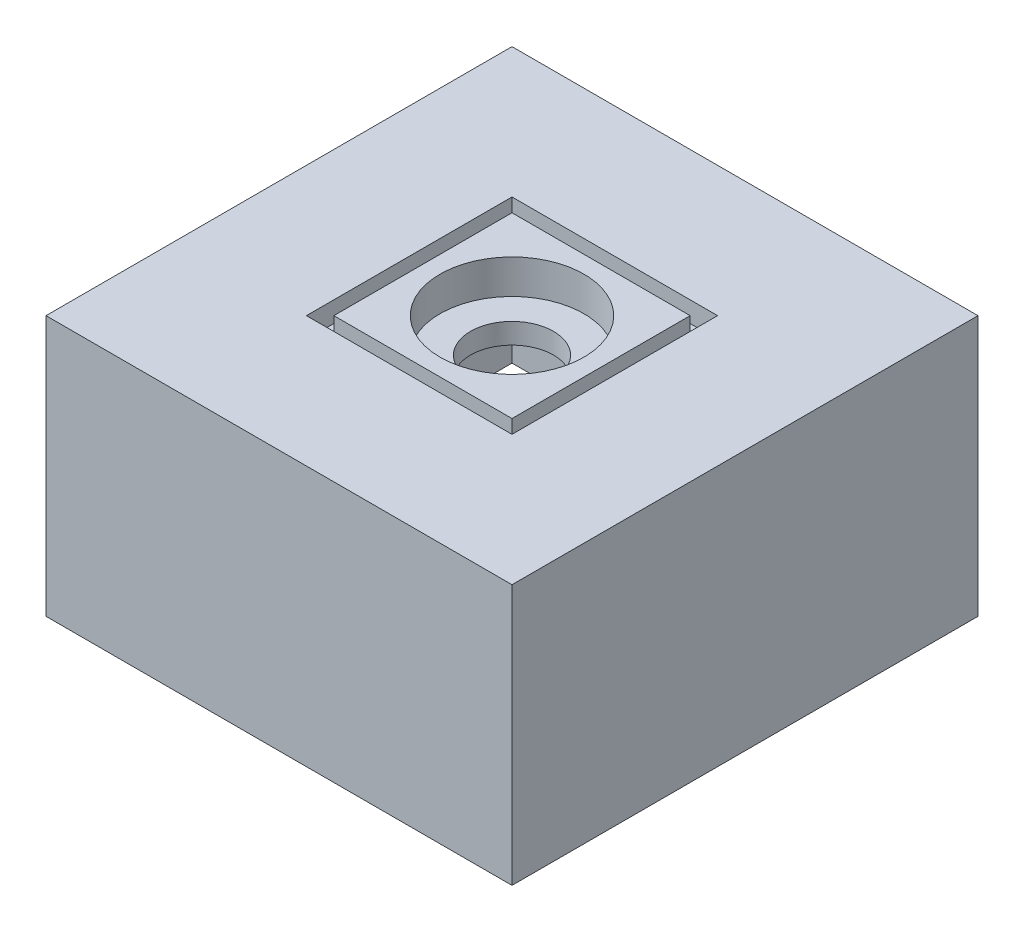
ISO-10303-21;
HEADER;
FILE_DESCRIPTION(('STEP AP214'),'2;1');
FILE_NAME('part.step','',(''),(''),'','','');
FILE_SCHEMA(('AUTOMOTIVE_DESIGN { 1 0 10303 214 1 1 1 1 }'));
ENDSEC;
DATA;
#1=APPLICATION_CONTEXT('core data for automotive mechanical design processes');
#2=APPLICATION_PROTOCOL_DEFINITION('international standard','automotive_design',2000,#1);
#3=PRODUCT_CONTEXT('',#1,'mechanical');
#4=PRODUCT('Part','Part','',(#3));
#5=PRODUCT_RELATED_PRODUCT_CATEGORY('part','',(#4));
#6=PRODUCT_DEFINITION_FORMATION('','',#4);
#7=PRODUCT_DEFINITION_CONTEXT('part definition',#1,'design');
#8=PRODUCT_DEFINITION('design','',#6,#7);
#9=PRODUCT_DEFINITION_SHAPE('','',#8);
#10=(LENGTH_UNIT() NAMED_UNIT(*) SI_UNIT(.MILLI.,.METRE.));
#11=(NAMED_UNIT(*) PLANE_ANGLE_UNIT() SI_UNIT($,.RADIAN.));
#12=(NAMED_UNIT(*) SI_UNIT($,.STERADIAN.) SOLID_ANGLE_UNIT());
#13=UNCERTAINTY_MEASURE_WITH_UNIT(LENGTH_MEASURE(1.E-05),#10,'distance_accuracy_value','');
#14=(GEOMETRIC_REPRESENTATION_CONTEXT(3) GLOBAL_UNCERTAINTY_ASSIGNED_CONTEXT((#13)) GLOBAL_UNIT_ASSIGNED_CONTEXT((#10,
#11,#12)) REPRESENTATION_CONTEXT('',''));
#15=CARTESIAN_POINT('',(0.,0.,0.));
#16=DIRECTION('',(0.,0.,1.));
#17=DIRECTION('',(1.,0.,0.));
#18=AXIS2_PLACEMENT_3D('',#15,#16,#17);
#19=CARTESIAN_POINT('',(34.,0.,34.));
#20=DIRECTION('',(0.,1.,0.));
#21=DIRECTION('',(0.,0.,1.));
#22=AXIS2_PLACEMENT_3D('',#19,#20,#21);
#23=CYLINDRICAL_SURFACE('',#22,6.05);
#24=CARTESIAN_POINT('',(34.,30.,34.));
#25=DIRECTION('',(0.,-1.,0.));
#26=DIRECTION('',(0.,0.,-1.));
#27=AXIS2_PLACEMENT_3D('',#24,#25,#26);
#28=CIRCLE('',#27,6.05);
#29=CARTESIAN_POINT('',(34.,30.,27.95));
#30=VERTEX_POINT('',#29);
#31=EDGE_CURVE('E184',#30,#30,#28,.T.);
#32=ORIENTED_EDGE('',*,*,#31,.T.);
#33=EDGE_LOOP('',(#32));
#34=FACE_BOUND('',#33,.T.);
#35=CARTESIAN_POINT('',(34.,33.,34.));
#36=DIRECTION('',(0.,1.,0.));
#37=DIRECTION('',(0.,0.,1.));
#38=AXIS2_PLACEMENT_3D('',#35,#36,#37);
#39=CIRCLE('',#38,6.05);
#40=CARTESIAN_POINT('',(34.,33.,40.05));
#41=VERTEX_POINT('',#40);
#42=EDGE_CURVE('E42',#41,#41,#39,.F.);
#43=ORIENTED_EDGE('',*,*,#42,.F.);
#44=EDGE_LOOP('',(#43));
#45=FACE_BOUND('',#44,.T.);
#46=ADVANCED_FACE('F38',(#34,#45),#23,.F.);
#47=CARTESIAN_POINT('',(0.,38.,0.));
#48=DIRECTION('',(1.,0.,0.));
#49=DIRECTION('',(0.,0.,-1.));
#50=AXIS2_PLACEMENT_3D('',#47,#48,#49);
#51=PLANE('',#50);
#52=DIRECTION('',(0.,0.,1.));
#53=VECTOR('',#52,1.);
#54=CARTESIAN_POINT('',(0.,0.,0.));
#55=LINE('',#54,#53);
#56=CARTESIAN_POINT('',(0.,0.,0.));
#57=VERTEX_POINT('',#56);
#58=CARTESIAN_POINT('',(0.,0.,68.));
#59=VERTEX_POINT('',#58);
#60=EDGE_CURVE('E253',#57,#59,#55,.T.);
#61=ORIENTED_EDGE('',*,*,#60,.T.);
#62=DIRECTION('',(0.,-1.,0.));
#63=VECTOR('',#62,1.);
#64=CARTESIAN_POINT('',(0.,38.,68.));
#65=LINE('',#64,#63);
#66=CARTESIAN_POINT('',(0.,38.,68.));
#67=VERTEX_POINT('',#66);
#68=EDGE_CURVE('E47',#67,#59,#65,.T.);
#69=ORIENTED_EDGE('',*,*,#68,.F.);
#70=DIRECTION('',(0.,0.,1.));
#71=VECTOR('',#70,1.);
#72=CARTESIAN_POINT('',(0.,38.,0.));
#73=LINE('',#72,#71);
#74=CARTESIAN_POINT('',(0.,38.,0.));
#75=VERTEX_POINT('',#74);
#76=EDGE_CURVE('E260',#75,#67,#73,.T.);
#77=ORIENTED_EDGE('',*,*,#76,.F.);
#78=DIRECTION('',(0.,-1.,0.));
#79=VECTOR('',#78,1.);
#80=CARTESIAN_POINT('',(0.,38.,0.));
#81=LINE('',#80,#79);
#82=EDGE_CURVE('E270',#75,#57,#81,.T.);
#83=ORIENTED_EDGE('',*,*,#82,.T.);
#84=EDGE_LOOP('',(#61,#69,#77,#83));
#85=FACE_BOUND('',#84,.T.);
#86=ADVANCED_FACE('F40',(#85),#51,.F.);
#87=CARTESIAN_POINT('',(0.,38.,68.));
#88=DIRECTION('',(0.,0.,-1.));
#89=DIRECTION('',(-1.,0.,0.));
#90=AXIS2_PLACEMENT_3D('',#87,#88,#89);
#91=PLANE('',#90);
#92=DIRECTION('',(1.,0.,0.));
#93=VECTOR('',#92,1.);
#94=CARTESIAN_POINT('',(0.,0.,68.));
#95=LINE('',#94,#93);
#96=CARTESIAN_POINT('',(68.,0.,68.));
#97=VERTEX_POINT('',#96);
#98=EDGE_CURVE('E273',#59,#97,#95,.T.);
#99=ORIENTED_EDGE('',*,*,#98,.T.);
#100=DIRECTION('',(0.,-1.,0.));
#101=VECTOR('',#100,1.);
#102=CARTESIAN_POINT('',(68.,38.,68.));
#103=LINE('',#102,#101);
#104=CARTESIAN_POINT('',(68.,38.,68.));
#105=VERTEX_POINT('',#104);
#106=EDGE_CURVE('E283',#105,#97,#103,.T.);
#107=ORIENTED_EDGE('',*,*,#106,.F.);
#108=DIRECTION('',(1.,0.,0.));
#109=VECTOR('',#108,1.);
#110=CARTESIAN_POINT('',(0.,38.,68.));
#111=LINE('',#110,#109);
#112=EDGE_CURVE('E263',#67,#105,#111,.T.);
#113=ORIENTED_EDGE('',*,*,#112,.F.);
#114=ORIENTED_EDGE('',*,*,#68,.T.);
#115=EDGE_LOOP('',(#99,#107,#113,#114));
#116=FACE_BOUND('',#115,.T.);
#117=ADVANCED_FACE('F288',(#116),#91,.F.);
#118=CARTESIAN_POINT('',(68.,38.,0.));
#119=DIRECTION('',(-1.,0.,0.));
#120=DIRECTION('',(0.,0.,1.));
#121=AXIS2_PLACEMENT_3D('',#118,#119,#120);
#122=PLANE('',#121);
#123=DIRECTION('',(0.,0.,-1.));
#124=VECTOR('',#123,1.);
#125=CARTESIAN_POINT('',(68.,0.,0.));
#126=LINE('',#125,#124);
#127=CARTESIAN_POINT('',(68.,0.,0.));
#128=VERTEX_POINT('',#127);
#129=EDGE_CURVE('E275',#97,#128,#126,.T.);
#130=ORIENTED_EDGE('',*,*,#129,.T.);
#131=DIRECTION('',(0.,-1.,0.));
#132=VECTOR('',#131,1.);
#133=CARTESIAN_POINT('',(68.,38.,0.));
#134=LINE('',#133,#132);
#135=CARTESIAN_POINT('',(68.,38.,0.));
#136=VERTEX_POINT('',#135);
#137=EDGE_CURVE('E280',#136,#128,#134,.T.);
#138=ORIENTED_EDGE('',*,*,#137,.F.);
#139=DIRECTION('',(0.,0.,-1.));
#140=VECTOR('',#139,1.);
#141=CARTESIAN_POINT('',(68.,38.,0.));
#142=LINE('',#141,#140);
#143=EDGE_CURVE('E266',#105,#136,#142,.T.);
#144=ORIENTED_EDGE('',*,*,#143,.F.);
#145=ORIENTED_EDGE('',*,*,#106,.T.);
#146=EDGE_LOOP('',(#130,#138,#144,#145));
#147=FACE_BOUND('',#146,.T.);
#148=ADVANCED_FACE('F300',(#147),#122,.F.);
#149=CARTESIAN_POINT('',(0.,38.,0.));
#150=DIRECTION('',(0.,0.,1.));
#151=DIRECTION('',(1.,0.,0.));
#152=AXIS2_PLACEMENT_3D('',#149,#150,#151);
#153=PLANE('',#152);
#154=CARTESIAN_POINT('',(56.,5.,0.));
#155=DIRECTION('',(0.,0.,1.));
#156=DIRECTION('',(1.,0.,0.));
#157=AXIS2_PLACEMENT_3D('',#154,#155,#156);
#158=CIRCLE('',#157,1.5);
#159=CARTESIAN_POINT('',(57.5,5.,0.));
#160=VERTEX_POINT('',#159);
#161=EDGE_CURVE('E589',#160,#160,#158,.T.);
#162=ORIENTED_EDGE('',*,*,#161,.T.);
#163=EDGE_LOOP('',(#162));
#164=FACE_BOUND('',#163,.T.);
#165=DIRECTION('',(-1.,0.,0.));
#166=VECTOR('',#165,1.);
#167=CARTESIAN_POINT('',(0.,0.,0.));
#168=LINE('',#167,#166);
#169=EDGE_CURVE('E264',#128,#57,#168,.T.);
#170=ORIENTED_EDGE('',*,*,#169,.T.);
#171=ORIENTED_EDGE('',*,*,#82,.F.);
#172=DIRECTION('',(-1.,0.,0.));
#173=VECTOR('',#172,1.);
#174=CARTESIAN_POINT('',(0.,38.,0.));
#175=LINE('',#174,#173);
#176=EDGE_CURVE('E268',#136,#75,#175,.T.);
#177=ORIENTED_EDGE('',*,*,#176,.F.);
#178=ORIENTED_EDGE('',*,*,#137,.T.);
#179=EDGE_LOOP('',(#170,#171,#177,#178));
#180=FACE_BOUND('',#179,.T.);
#181=ADVANCED_FACE('F304',(#164,#180),#153,.F.);
#182=CARTESIAN_POINT('',(0.,38.,0.));
#183=DIRECTION('',(0.,1.,0.));
#184=DIRECTION('',(0.,0.,1.));
#185=AXIS2_PLACEMENT_3D('',#182,#183,#184);
#186=PLANE('',#185);
#187=DIRECTION('',(0.,0.,1.));
#188=VECTOR('',#187,1.);
#189=CARTESIAN_POINT('',(19.,38.,19.));
#190=LINE('',#189,#188);
#191=CARTESIAN_POINT('',(19.,38.,19.));
#192=VERTEX_POINT('',#191);
#193=CARTESIAN_POINT('',(19.,38.,49.));
#194=VERTEX_POINT('',#193);
#195=EDGE_CURVE('E55',#192,#194,#190,.T.);
#196=ORIENTED_EDGE('',*,*,#195,.F.);
#197=DIRECTION('',(-1.,0.,0.));
#198=VECTOR('',#197,1.);
#199=CARTESIAN_POINT('',(19.,38.,19.));
#200=LINE('',#199,#198);
#201=CARTESIAN_POINT('',(49.,38.,19.));
#202=VERTEX_POINT('',#201);
#203=EDGE_CURVE('E201',#202,#192,#200,.T.);
#204=ORIENTED_EDGE('',*,*,#203,.F.);
#205=DIRECTION('',(0.,0.,-1.));
#206=VECTOR('',#205,1.);
#207=CARTESIAN_POINT('',(49.,38.,19.));
#208=LINE('',#207,#206);
#209=CARTESIAN_POINT('',(49.,38.,49.));
#210=VERTEX_POINT('',#209);
#211=EDGE_CURVE('E215',#210,#202,#208,.T.);
#212=ORIENTED_EDGE('',*,*,#211,.F.);
#213=DIRECTION('',(1.,0.,0.));
#214=VECTOR('',#213,1.);
#215=CARTESIAN_POINT('',(19.,38.,49.));
#216=LINE('',#215,#214);
#217=EDGE_CURVE('E212',#194,#210,#216,.T.);
#218=ORIENTED_EDGE('',*,*,#217,.F.);
#219=EDGE_LOOP('',(#196,#204,#212,#218));
#220=FACE_BOUND('',#219,.T.);
#221=ORIENTED_EDGE('',*,*,#76,.T.);
#222=ORIENTED_EDGE('',*,*,#112,.T.);
#223=ORIENTED_EDGE('',*,*,#143,.T.);
#224=ORIENTED_EDGE('',*,*,#176,.T.);
#225=EDGE_LOOP('',(#221,#222,#223,#224));
#226=FACE_BOUND('',#225,.T.);
#227=ADVANCED_FACE('F306',(#220,#226),#186,.T.);
#228=CARTESIAN_POINT('',(0.,0.,0.));
#229=DIRECTION('',(0.,1.,0.));
#230=DIRECTION('',(0.,0.,1.));
#231=AXIS2_PLACEMENT_3D('',#228,#229,#230);
#232=PLANE('',#231);
#233=DIRECTION('',(1.,0.,0.));
#234=VECTOR('',#233,1.);
#235=CARTESIAN_POINT('',(2.00000000000001,0.,2.));
#236=LINE('',#235,#234);
#237=CARTESIAN_POINT('',(2.00000000000001,0.,2.));
#238=VERTEX_POINT('',#237);
#239=CARTESIAN_POINT('',(66.,0.,2.));
#240=VERTEX_POINT('',#239);
#241=EDGE_CURVE('E243',#238,#240,#236,.T.);
#242=ORIENTED_EDGE('',*,*,#241,.F.);
#243=DIRECTION('',(0.,0.,-1.));
#244=VECTOR('',#243,1.);
#245=CARTESIAN_POINT('',(1.99999999999999,0.,66.));
#246=LINE('',#245,#244);
#247=CARTESIAN_POINT('',(1.99999999999999,0.,66.));
#248=VERTEX_POINT('',#247);
#249=EDGE_CURVE('E222',#248,#238,#246,.T.);
#250=ORIENTED_EDGE('',*,*,#249,.F.);
#251=DIRECTION('',(-1.,0.,0.));
#252=VECTOR('',#251,1.);
#253=CARTESIAN_POINT('',(1.99999999999999,0.,66.));
#254=LINE('',#253,#252);
#255=CARTESIAN_POINT('',(66.,0.,66.));
#256=VERTEX_POINT('',#255);
#257=EDGE_CURVE('E232',#256,#248,#254,.T.);
#258=ORIENTED_EDGE('',*,*,#257,.F.);
#259=DIRECTION('',(0.,0.,1.));
#260=VECTOR('',#259,1.);
#261=CARTESIAN_POINT('',(66.,0.,66.));
#262=LINE('',#261,#260);
#263=EDGE_CURVE('E246',#240,#256,#262,.T.);
#264=ORIENTED_EDGE('',*,*,#263,.F.);
#265=EDGE_LOOP('',(#242,#250,#258,#264));
#266=FACE_BOUND('',#265,.T.);
#267=ORIENTED_EDGE('',*,*,#60,.F.);
#268=ORIENTED_EDGE('',*,*,#169,.F.);
#269=ORIENTED_EDGE('',*,*,#129,.F.);
#270=ORIENTED_EDGE('',*,*,#98,.F.);
#271=EDGE_LOOP('',(#267,#268,#269,#270));
#272=FACE_BOUND('',#271,.T.);
#273=ADVANCED_FACE('F296',(#266,#272),#232,.F.);
#274=CARTESIAN_POINT('',(1.99999999999999,30.,66.));
#275=DIRECTION('',(-1.,0.,0.));
#276=DIRECTION('',(0.,0.,1.));
#277=AXIS2_PLACEMENT_3D('',#274,#275,#276);
#278=PLANE('',#277);
#279=ORIENTED_EDGE('',*,*,#249,.T.);
#280=DIRECTION('',(0.,-1.,0.));
#281=VECTOR('',#280,1.);
#282=CARTESIAN_POINT('',(2.00000000000001,30.,2.));
#283=LINE('',#282,#281);
#284=CARTESIAN_POINT('',(2.00000000000001,30.,2.));
#285=VERTEX_POINT('',#284);
#286=EDGE_CURVE('E241',#285,#238,#283,.T.);
#287=ORIENTED_EDGE('',*,*,#286,.F.);
#288=DIRECTION('',(0.,0.,-1.));
#289=VECTOR('',#288,1.);
#290=CARTESIAN_POINT('',(1.99999999999999,30.,66.));
#291=LINE('',#290,#289);
#292=CARTESIAN_POINT('',(1.99999999999999,30.,66.));
#293=VERTEX_POINT('',#292);
#294=EDGE_CURVE('E228',#293,#285,#291,.T.);
#295=ORIENTED_EDGE('',*,*,#294,.F.);
#296=DIRECTION('',(0.,-1.,0.));
#297=VECTOR('',#296,1.);
#298=CARTESIAN_POINT('',(1.99999999999999,30.,66.));
#299=LINE('',#298,#297);
#300=EDGE_CURVE('E251',#293,#248,#299,.T.);
#301=ORIENTED_EDGE('',*,*,#300,.T.);
#302=EDGE_LOOP('',(#279,#287,#295,#301));
#303=FACE_BOUND('',#302,.T.);
#304=ADVANCED_FACE('F315',(#303),#278,.F.);
#305=CARTESIAN_POINT('',(1.99999999999999,30.,66.));
#306=DIRECTION('',(0.,0.,1.));
#307=DIRECTION('',(1.,0.,0.));
#308=AXIS2_PLACEMENT_3D('',#305,#306,#307);
#309=PLANE('',#308);
#310=ORIENTED_EDGE('',*,*,#257,.T.);
#311=ORIENTED_EDGE('',*,*,#300,.F.);
#312=DIRECTION('',(-1.,0.,0.));
#313=VECTOR('',#312,1.);
#314=CARTESIAN_POINT('',(1.99999999999999,30.,66.));
#315=LINE('',#314,#313);
#316=CARTESIAN_POINT('',(66.,30.,66.));
#317=VERTEX_POINT('',#316);
#318=EDGE_CURVE('E238',#317,#293,#315,.T.);
#319=ORIENTED_EDGE('',*,*,#318,.F.);
#320=DIRECTION('',(0.,-1.,0.));
#321=VECTOR('',#320,1.);
#322=CARTESIAN_POINT('',(66.,30.,66.));
#323=LINE('',#322,#321);
#324=EDGE_CURVE('E254',#317,#256,#323,.T.);
#325=ORIENTED_EDGE('',*,*,#324,.T.);
#326=EDGE_LOOP('',(#310,#311,#319,#325));
#327=FACE_BOUND('',#326,.T.);
#328=ADVANCED_FACE('F370',(#327),#309,.F.);
#329=CARTESIAN_POINT('',(66.,30.,66.));
#330=DIRECTION('',(1.,0.,0.));
#331=DIRECTION('',(0.,0.,-1.));
#332=AXIS2_PLACEMENT_3D('',#329,#330,#331);
#333=PLANE('',#332);
#334=ORIENTED_EDGE('',*,*,#263,.T.);
#335=ORIENTED_EDGE('',*,*,#324,.F.);
#336=DIRECTION('',(0.,0.,1.));
#337=VECTOR('',#336,1.);
#338=CARTESIAN_POINT('',(66.,30.,66.));
#339=LINE('',#338,#337);
#340=CARTESIAN_POINT('',(66.,30.,2.));
#341=VERTEX_POINT('',#340);
#342=EDGE_CURVE('E235',#341,#317,#339,.T.);
#343=ORIENTED_EDGE('',*,*,#342,.F.);
#344=DIRECTION('',(0.,-1.,0.));
#345=VECTOR('',#344,1.);
#346=CARTESIAN_POINT('',(66.,30.,2.));
#347=LINE('',#346,#345);
#348=EDGE_CURVE('E256',#341,#240,#347,.T.);
#349=ORIENTED_EDGE('',*,*,#348,.T.);
#350=EDGE_LOOP('',(#334,#335,#343,#349));
#351=FACE_BOUND('',#350,.T.);
#352=ADVANCED_FACE('F373',(#351),#333,.F.);
#353=CARTESIAN_POINT('',(2.00000000000001,30.,2.));
#354=DIRECTION('',(0.,0.,-1.));
#355=DIRECTION('',(-1.,0.,0.));
#356=AXIS2_PLACEMENT_3D('',#353,#354,#355);
#357=PLANE('',#356);
#358=CARTESIAN_POINT('',(56.,5.,2.));
#359=DIRECTION('',(0.,0.,1.));
#360=DIRECTION('',(1.,0.,0.));
#361=AXIS2_PLACEMENT_3D('',#358,#359,#360);
#362=CIRCLE('',#361,1.5);
#363=CARTESIAN_POINT('',(57.5,5.,2.));
#364=VERTEX_POINT('',#363);
#365=EDGE_CURVE('E586',#364,#364,#362,.T.);
#366=ORIENTED_EDGE('',*,*,#365,.F.);
#367=EDGE_LOOP('',(#366));
#368=FACE_BOUND('',#367,.T.);
#369=ORIENTED_EDGE('',*,*,#241,.T.);
#370=ORIENTED_EDGE('',*,*,#348,.F.);
#371=DIRECTION('',(1.,0.,0.));
#372=VECTOR('',#371,1.);
#373=CARTESIAN_POINT('',(2.00000000000001,30.,2.));
#374=LINE('',#373,#372);
#375=EDGE_CURVE('E231',#285,#341,#374,.T.);
#376=ORIENTED_EDGE('',*,*,#375,.F.);
#377=ORIENTED_EDGE('',*,*,#286,.T.);
#378=EDGE_LOOP('',(#369,#370,#376,#377));
#379=FACE_BOUND('',#378,.T.);
#380=ADVANCED_FACE('F368',(#368,#379),#357,.F.);
#381=CARTESIAN_POINT('',(0.,30.,0.));
#382=DIRECTION('',(0.,-1.,0.));
#383=DIRECTION('',(0.,0.,-1.));
#384=AXIS2_PLACEMENT_3D('',#381,#382,#383);
#385=PLANE('',#384);
#386=CARTESIAN_POINT('',(9.99999999999999,30.,58.));
#387=DIRECTION('',(0.,-1.,0.));
#388=DIRECTION('',(0.,0.,-1.));
#389=AXIS2_PLACEMENT_3D('',#386,#387,#388);
#390=CIRCLE('',#389,2.5);
#391=CARTESIAN_POINT('',(9.99999999999999,30.,55.5));
#392=VERTEX_POINT('',#391);
#393=EDGE_CURVE('E581',#392,#392,#390,.T.);
#394=ORIENTED_EDGE('',*,*,#393,.F.);
#395=EDGE_LOOP('',(#394));
#396=FACE_BOUND('',#395,.T.);
#397=ORIENTED_EDGE('',*,*,#31,.F.);
#398=EDGE_LOOP('',(#397));
#399=FACE_BOUND('',#398,.T.);
#400=ORIENTED_EDGE('',*,*,#294,.T.);
#401=ORIENTED_EDGE('',*,*,#375,.T.);
#402=ORIENTED_EDGE('',*,*,#342,.T.);
#403=ORIENTED_EDGE('',*,*,#318,.T.);
#404=EDGE_LOOP('',(#400,#401,#402,#403));
#405=FACE_BOUND('',#404,.T.);
#406=ADVANCED_FACE('F365',(#396,#399,#405),#385,.T.);
#407=CARTESIAN_POINT('',(19.,35.,19.));
#408=DIRECTION('',(-1.,0.,0.));
#409=DIRECTION('',(0.,0.,1.));
#410=AXIS2_PLACEMENT_3D('',#407,#408,#409);
#411=PLANE('',#410);
#412=ORIENTED_EDGE('',*,*,#195,.T.);
#413=DIRECTION('',(0.,1.,0.));
#414=VECTOR('',#413,1.);
#415=CARTESIAN_POINT('',(19.,35.,49.));
#416=LINE('',#415,#414);
#417=CARTESIAN_POINT('',(19.,35.,49.));
#418=VERTEX_POINT('',#417);
#419=EDGE_CURVE('E210',#418,#194,#416,.T.);
#420=ORIENTED_EDGE('',*,*,#419,.F.);
#421=DIRECTION('',(0.,0.,1.));
#422=VECTOR('',#421,1.);
#423=CARTESIAN_POINT('',(19.,35.,19.));
#424=LINE('',#423,#422);
#425=CARTESIAN_POINT('',(19.,35.,19.));
#426=VERTEX_POINT('',#425);
#427=EDGE_CURVE('E197',#426,#418,#424,.T.);
#428=ORIENTED_EDGE('',*,*,#427,.F.);
#429=DIRECTION('',(0.,1.,0.));
#430=VECTOR('',#429,1.);
#431=CARTESIAN_POINT('',(19.,35.,19.));
#432=LINE('',#431,#430);
#433=EDGE_CURVE('E220',#426,#192,#432,.T.);
#434=ORIENTED_EDGE('',*,*,#433,.T.);
#435=EDGE_LOOP('',(#412,#420,#428,#434));
#436=FACE_BOUND('',#435,.T.);
#437=ADVANCED_FACE('F355',(#436),#411,.F.);
#438=CARTESIAN_POINT('',(19.,35.,19.));
#439=DIRECTION('',(0.,0.,-1.));
#440=DIRECTION('',(-1.,0.,0.));
#441=AXIS2_PLACEMENT_3D('',#438,#439,#440);
#442=PLANE('',#441);
#443=ORIENTED_EDGE('',*,*,#203,.T.);
#444=ORIENTED_EDGE('',*,*,#433,.F.);
#445=DIRECTION('',(-1.,0.,0.));
#446=VECTOR('',#445,1.);
#447=CARTESIAN_POINT('',(19.,35.,19.));
#448=LINE('',#447,#446);
#449=CARTESIAN_POINT('',(49.,35.,19.));
#450=VERTEX_POINT('',#449);
#451=EDGE_CURVE('E207',#450,#426,#448,.T.);
#452=ORIENTED_EDGE('',*,*,#451,.F.);
#453=DIRECTION('',(0.,1.,0.));
#454=VECTOR('',#453,1.);
#455=CARTESIAN_POINT('',(49.,35.,19.));
#456=LINE('',#455,#454);
#457=EDGE_CURVE('E223',#450,#202,#456,.T.);
#458=ORIENTED_EDGE('',*,*,#457,.T.);
#459=EDGE_LOOP('',(#443,#444,#452,#458));
#460=FACE_BOUND('',#459,.T.);
#461=ADVANCED_FACE('F351',(#460),#442,.F.);
#462=CARTESIAN_POINT('',(49.,35.,19.));
#463=DIRECTION('',(1.,0.,0.));
#464=DIRECTION('',(0.,0.,-1.));
#465=AXIS2_PLACEMENT_3D('',#462,#463,#464);
#466=PLANE('',#465);
#467=ORIENTED_EDGE('',*,*,#211,.T.);
#468=ORIENTED_EDGE('',*,*,#457,.F.);
#469=DIRECTION('',(0.,0.,-1.));
#470=VECTOR('',#469,1.);
#471=CARTESIAN_POINT('',(49.,35.,19.));
#472=LINE('',#471,#470);
#473=CARTESIAN_POINT('',(49.,35.,49.));
#474=VERTEX_POINT('',#473);
#475=EDGE_CURVE('E204',#474,#450,#472,.T.);
#476=ORIENTED_EDGE('',*,*,#475,.F.);
#477=DIRECTION('',(0.,1.,0.));
#478=VECTOR('',#477,1.);
#479=CARTESIAN_POINT('',(49.,35.,49.));
#480=LINE('',#479,#478);
#481=EDGE_CURVE('E225',#474,#210,#480,.T.);
#482=ORIENTED_EDGE('',*,*,#481,.T.);
#483=EDGE_LOOP('',(#467,#468,#476,#482));
#484=FACE_BOUND('',#483,.T.);
#485=ADVANCED_FACE('F354',(#484),#466,.F.);
#486=CARTESIAN_POINT('',(19.,35.,49.));
#487=DIRECTION('',(0.,0.,1.));
#488=DIRECTION('',(1.,0.,0.));
#489=AXIS2_PLACEMENT_3D('',#486,#487,#488);
#490=PLANE('',#489);
#491=ORIENTED_EDGE('',*,*,#217,.T.);
#492=ORIENTED_EDGE('',*,*,#481,.F.);
#493=DIRECTION('',(1.,0.,0.));
#494=VECTOR('',#493,1.);
#495=CARTESIAN_POINT('',(19.,35.,49.));
#496=LINE('',#495,#494);
#497=EDGE_CURVE('E200',#418,#474,#496,.T.);
#498=ORIENTED_EDGE('',*,*,#497,.F.);
#499=ORIENTED_EDGE('',*,*,#419,.T.);
#500=EDGE_LOOP('',(#491,#492,#498,#499));
#501=FACE_BOUND('',#500,.T.);
#502=ADVANCED_FACE('F350',(#501),#490,.F.);
#503=CARTESIAN_POINT('',(0.,35.,0.));
#504=DIRECTION('',(0.,1.,0.));
#505=DIRECTION('',(0.,0.,1.));
#506=AXIS2_PLACEMENT_3D('',#503,#504,#505);
#507=PLANE('',#506);
#508=DIRECTION('',(-1.,0.,0.));
#509=VECTOR('',#508,1.);
#510=CARTESIAN_POINT('',(21.,35.,21.));
#511=LINE('',#510,#509);
#512=CARTESIAN_POINT('',(47.,35.,21.));
#513=VERTEX_POINT('',#512);
#514=CARTESIAN_POINT('',(21.,35.,21.));
#515=VERTEX_POINT('',#514);
#516=EDGE_CURVE('E165',#513,#515,#511,.T.);
#517=ORIENTED_EDGE('',*,*,#516,.F.);
#518=DIRECTION('',(0.,0.,-1.));
#519=VECTOR('',#518,1.);
#520=CARTESIAN_POINT('',(47.,35.,21.));
#521=LINE('',#520,#519);
#522=CARTESIAN_POINT('',(47.,35.,47.));
#523=VERTEX_POINT('',#522);
#524=EDGE_CURVE('E175',#523,#513,#521,.T.);
#525=ORIENTED_EDGE('',*,*,#524,.F.);
#526=DIRECTION('',(1.,0.,0.));
#527=VECTOR('',#526,1.);
#528=CARTESIAN_POINT('',(21.,35.,47.));
#529=LINE('',#528,#527);
#530=CARTESIAN_POINT('',(21.,35.,47.));
#531=VERTEX_POINT('',#530);
#532=EDGE_CURVE('E157',#531,#523,#529,.T.);
#533=ORIENTED_EDGE('',*,*,#532,.F.);
#534=DIRECTION('',(0.,0.,1.));
#535=VECTOR('',#534,1.);
#536=CARTESIAN_POINT('',(21.,35.,21.));
#537=LINE('',#536,#535);
#538=EDGE_CURVE('E172',#515,#531,#537,.T.);
#539=ORIENTED_EDGE('',*,*,#538,.F.);
#540=EDGE_LOOP('',(#517,#525,#533,#539));
#541=FACE_BOUND('',#540,.T.);
#542=ORIENTED_EDGE('',*,*,#427,.T.);
#543=ORIENTED_EDGE('',*,*,#497,.T.);
#544=ORIENTED_EDGE('',*,*,#475,.T.);
#545=ORIENTED_EDGE('',*,*,#451,.T.);
#546=EDGE_LOOP('',(#542,#543,#544,#545));
#547=FACE_BOUND('',#546,.T.);
#548=ADVANCED_FACE('F170',(#541,#547),#507,.T.);
#549=CARTESIAN_POINT('',(21.,35.,21.));
#550=DIRECTION('',(-1.,0.,0.));
#551=DIRECTION('',(0.,0.,1.));
#552=AXIS2_PLACEMENT_3D('',#549,#550,#551);
#553=PLANE('',#552);
#554=DIRECTION('',(0.,0.,1.));
#555=VECTOR('',#554,1.);
#556=CARTESIAN_POINT('',(21.,38.,21.));
#557=LINE('',#556,#555);
#558=CARTESIAN_POINT('',(21.,38.,21.));
#559=VERTEX_POINT('',#558);
#560=CARTESIAN_POINT('',(21.,38.,47.));
#561=VERTEX_POINT('',#560);
#562=EDGE_CURVE('E189',#559,#561,#557,.T.);
#563=ORIENTED_EDGE('',*,*,#562,.F.);
#564=DIRECTION('',(0.,1.,0.));
#565=VECTOR('',#564,1.);
#566=CARTESIAN_POINT('',(21.,35.,21.));
#567=LINE('',#566,#565);
#568=EDGE_CURVE('E178',#515,#559,#567,.T.);
#569=ORIENTED_EDGE('',*,*,#568,.F.);
#570=ORIENTED_EDGE('',*,*,#538,.T.);
#571=DIRECTION('',(0.,1.,0.));
#572=VECTOR('',#571,1.);
#573=CARTESIAN_POINT('',(21.,35.,47.));
#574=LINE('',#573,#572);
#575=EDGE_CURVE('E154',#531,#561,#574,.T.);
#576=ORIENTED_EDGE('',*,*,#575,.T.);
#577=EDGE_LOOP('',(#563,#569,#570,#576));
#578=FACE_BOUND('',#577,.T.);
#579=ADVANCED_FACE('F177',(#578),#553,.T.);
#580=CARTESIAN_POINT('',(21.,35.,21.));
#581=DIRECTION('',(0.,0.,-1.));
#582=DIRECTION('',(-1.,0.,0.));
#583=AXIS2_PLACEMENT_3D('',#580,#581,#582);
#584=PLANE('',#583);
#585=DIRECTION('',(-1.,0.,0.));
#586=VECTOR('',#585,1.);
#587=CARTESIAN_POINT('',(21.,38.,21.));
#588=LINE('',#587,#586);
#589=CARTESIAN_POINT('',(47.,38.,21.));
#590=VERTEX_POINT('',#589);
#591=EDGE_CURVE('E179',#590,#559,#588,.T.);
#592=ORIENTED_EDGE('',*,*,#591,.F.);
#593=DIRECTION('',(0.,1.,0.));
#594=VECTOR('',#593,1.);
#595=CARTESIAN_POINT('',(47.,35.,21.));
#596=LINE('',#595,#594);
#597=EDGE_CURVE('E194',#513,#590,#596,.T.);
#598=ORIENTED_EDGE('',*,*,#597,.F.);
#599=ORIENTED_EDGE('',*,*,#516,.T.);
#600=ORIENTED_EDGE('',*,*,#568,.T.);
#601=EDGE_LOOP('',(#592,#598,#599,#600));
#602=FACE_BOUND('',#601,.T.);
#603=ADVANCED_FACE('F337',(#602),#584,.T.);
#604=CARTESIAN_POINT('',(47.,35.,21.));
#605=DIRECTION('',(1.,0.,0.));
#606=DIRECTION('',(0.,0.,-1.));
#607=AXIS2_PLACEMENT_3D('',#604,#605,#606);
#608=PLANE('',#607);
#609=DIRECTION('',(0.,0.,-1.));
#610=VECTOR('',#609,1.);
#611=CARTESIAN_POINT('',(47.,38.,21.));
#612=LINE('',#611,#610);
#613=CARTESIAN_POINT('',(47.,38.,47.));
#614=VERTEX_POINT('',#613);
#615=EDGE_CURVE('E63',#614,#590,#612,.T.);
#616=ORIENTED_EDGE('',*,*,#615,.F.);
#617=DIRECTION('',(0.,1.,0.));
#618=VECTOR('',#617,1.);
#619=CARTESIAN_POINT('',(47.,35.,47.));
#620=LINE('',#619,#618);
#621=EDGE_CURVE('E164',#523,#614,#620,.T.);
#622=ORIENTED_EDGE('',*,*,#621,.F.);
#623=ORIENTED_EDGE('',*,*,#524,.T.);
#624=ORIENTED_EDGE('',*,*,#597,.T.);
#625=EDGE_LOOP('',(#616,#622,#623,#624));
#626=FACE_BOUND('',#625,.T.);
#627=ADVANCED_FACE('F340',(#626),#608,.T.);
#628=CARTESIAN_POINT('',(21.,35.,47.));
#629=DIRECTION('',(0.,0.,1.));
#630=DIRECTION('',(1.,0.,0.));
#631=AXIS2_PLACEMENT_3D('',#628,#629,#630);
#632=PLANE('',#631);
#633=DIRECTION('',(1.,0.,0.));
#634=VECTOR('',#633,1.);
#635=CARTESIAN_POINT('',(21.,38.,47.));
#636=LINE('',#635,#634);
#637=EDGE_CURVE('E159',#561,#614,#636,.T.);
#638=ORIENTED_EDGE('',*,*,#637,.F.);
#639=ORIENTED_EDGE('',*,*,#575,.F.);
#640=ORIENTED_EDGE('',*,*,#532,.T.);
#641=ORIENTED_EDGE('',*,*,#621,.T.);
#642=EDGE_LOOP('',(#638,#639,#640,#641));
#643=FACE_BOUND('',#642,.T.);
#644=ADVANCED_FACE('F156',(#643),#632,.T.);
#645=CARTESIAN_POINT('',(34.,38.,34.));
#646=DIRECTION('',(0.,1.,0.));
#647=DIRECTION('',(0.,0.,1.));
#648=AXIS2_PLACEMENT_3D('',#645,#646,#647);
#649=CIRCLE('',#648,10.5);
#650=CARTESIAN_POINT('',(34.,38.,44.5));
#651=VERTEX_POINT('',#650);
#652=EDGE_CURVE('E592',#651,#651,#649,.T.);
#653=ORIENTED_EDGE('',*,*,#652,.F.);
#654=EDGE_LOOP('',(#653));
#655=FACE_BOUND('',#654,.T.);
#656=ORIENTED_EDGE('',*,*,#591,.T.);
#657=ORIENTED_EDGE('',*,*,#562,.T.);
#658=ORIENTED_EDGE('',*,*,#637,.T.);
#659=ORIENTED_EDGE('',*,*,#615,.T.);
#660=EDGE_LOOP('',(#656,#657,#658,#659));
#661=FACE_BOUND('',#660,.T.);
#662=ADVANCED_FACE('F310',(#655,#661),#186,.T.);
#663=CARTESIAN_POINT('',(34.,33.,34.));
#664=DIRECTION('',(0.,1.,0.));
#665=DIRECTION('',(0.,0.,1.));
#666=AXIS2_PLACEMENT_3D('',#663,#664,#665);
#667=PLANE('',#666);
#668=CARTESIAN_POINT('',(34.,33.,34.));
#669=DIRECTION('',(0.,1.,0.));
#670=DIRECTION('',(0.,0.,1.));
#671=AXIS2_PLACEMENT_3D('',#668,#669,#670);
#672=CIRCLE('',#671,10.5);
#673=CARTESIAN_POINT('',(34.,33.,44.5));
#674=VERTEX_POINT('',#673);
#675=EDGE_CURVE('E595',#674,#674,#672,.T.);
#676=ORIENTED_EDGE('',*,*,#675,.T.);
#677=EDGE_LOOP('',(#676));
#678=FACE_BOUND('',#677,.T.);
#679=ORIENTED_EDGE('',*,*,#42,.T.);
#680=EDGE_LOOP('',(#679));
#681=FACE_BOUND('',#680,.T.);
#682=ADVANCED_FACE('F323',(#678,#681),#667,.T.);
#683=CARTESIAN_POINT('',(34.,33.,34.));
#684=DIRECTION('',(0.,1.,0.));
#685=DIRECTION('',(0.,0.,1.));
#686=AXIS2_PLACEMENT_3D('',#683,#684,#685);
#687=CYLINDRICAL_SURFACE('',#686,10.5);
#688=ORIENTED_EDGE('',*,*,#675,.F.);
#689=EDGE_LOOP('',(#688));
#690=FACE_BOUND('',#689,.T.);
#691=ORIENTED_EDGE('',*,*,#652,.T.);
#692=EDGE_LOOP('',(#691));
#693=FACE_BOUND('',#692,.T.);
#694=ADVANCED_FACE('F335',(#690,#693),#687,.F.);
#695=CARTESIAN_POINT('',(56.,5.,0.));
#696=DIRECTION('',(0.,0.,1.));
#697=DIRECTION('',(1.,0.,0.));
#698=AXIS2_PLACEMENT_3D('',#695,#696,#697);
#699=CYLINDRICAL_SURFACE('',#698,1.5);
#700=ORIENTED_EDGE('',*,*,#161,.F.);
#701=EDGE_LOOP('',(#700));
#702=FACE_BOUND('',#701,.T.);
#703=ORIENTED_EDGE('',*,*,#365,.T.);
#704=EDGE_LOOP('',(#703));
#705=FACE_BOUND('',#704,.T.);
#706=ADVANCED_FACE('F470',(#702,#705),#699,.F.);
#707=CARTESIAN_POINT('',(9.99999999999999,22.5,58.));
#708=DIRECTION('',(0.,1.,0.));
#709=DIRECTION('',(0.,0.,1.));
#710=AXIS2_PLACEMENT_3D('',#707,#708,#709);
#711=CYLINDRICAL_SURFACE('',#710,2.5);
#712=CARTESIAN_POINT('',(9.99999999999999,22.5,58.));
#713=DIRECTION('',(0.,-1.,0.));
#714=DIRECTION('',(0.,0.,-1.));
#715=AXIS2_PLACEMENT_3D('',#712,#713,#714);
#716=CIRCLE('',#715,2.5);
#717=CARTESIAN_POINT('',(9.99999999999999,22.5,55.5));
#718=VERTEX_POINT('',#717);
#719=EDGE_CURVE('E583',#718,#718,#716,.T.);
#720=ORIENTED_EDGE('',*,*,#719,.F.);
#721=EDGE_LOOP('',(#720));
#722=FACE_BOUND('',#721,.T.);
#723=ORIENTED_EDGE('',*,*,#393,.T.);
#724=EDGE_LOOP('',(#723));
#725=FACE_BOUND('',#724,.T.);
#726=ADVANCED_FACE('F476',(#722,#725),#711,.T.);
#727=CARTESIAN_POINT('',(9.99999999999999,22.5,58.));
#728=DIRECTION('',(0.,-1.,0.));
#729=DIRECTION('',(0.,0.,-1.));
#730=AXIS2_PLACEMENT_3D('',#727,#728,#729);
#731=PLANE('',#730);
#732=CARTESIAN_POINT('',(9.99999999999999,22.5,58.));
#733=DIRECTION('',(0.,-1.,0.));
#734=DIRECTION('',(0.,0.,-1.));
#735=AXIS2_PLACEMENT_3D('',#732,#733,#734);
#736=CIRCLE('',#735,1.5);
#737=CARTESIAN_POINT('',(9.99999999999999,22.5,56.5));
#738=VERTEX_POINT('',#737);
#739=EDGE_CURVE('E11',#738,#738,#736,.T.);
#740=ORIENTED_EDGE('',*,*,#739,.F.);
#741=EDGE_LOOP('',(#740));
#742=FACE_BOUND('',#741,.T.);
#743=ORIENTED_EDGE('',*,*,#719,.T.);
#744=EDGE_LOOP('',(#743));
#745=FACE_BOUND('',#744,.T.);
#746=ADVANCED_FACE('F483',(#742,#745),#731,.T.);
#747=CARTESIAN_POINT('',(9.99999999999999,20.5,58.));
#748=DIRECTION('',(0.,1.,0.));
#749=DIRECTION('',(0.,0.,1.));
#750=AXIS2_PLACEMENT_3D('',#747,#748,#749);
#751=CYLINDRICAL_SURFACE('',#750,1.5);
#752=CARTESIAN_POINT('',(9.99999999999999,20.5,58.));
#753=DIRECTION('',(0.,-1.,0.));
#754=DIRECTION('',(0.,0.,-1.));
#755=AXIS2_PLACEMENT_3D('',#752,#753,#754);
#756=CIRCLE('',#755,1.5);
#757=CARTESIAN_POINT('',(9.99999999999999,20.5,56.5));
#758=VERTEX_POINT('',#757);
#759=EDGE_CURVE('E571',#758,#758,#756,.T.);
#760=ORIENTED_EDGE('',*,*,#759,.F.);
#761=EDGE_LOOP('',(#760));
#762=FACE_BOUND('',#761,.T.);
#763=ORIENTED_EDGE('',*,*,#739,.T.);
#764=EDGE_LOOP('',(#763));
#765=FACE_BOUND('',#764,.T.);
#766=ADVANCED_FACE('F491',(#762,#765),#751,.T.);
#767=CARTESIAN_POINT('',(9.99999999999999,18.5,58.));
#768=DIRECTION('',(0.,1.,0.));
#769=DIRECTION('',(0.,0.,1.));
#770=AXIS2_PLACEMENT_3D('',#767,#768,#769);
#771=CYLINDRICAL_SURFACE('',#770,2.5);
#772=CARTESIAN_POINT('',(9.99999999999999,18.5,58.));
#773=DIRECTION('',(0.,-1.,0.));
#774=DIRECTION('',(0.,0.,-1.));
#775=AXIS2_PLACEMENT_3D('',#772,#773,#774);
#776=CIRCLE('',#775,2.5);
#777=CARTESIAN_POINT('',(9.99999999999999,18.5,55.5));
#778=VERTEX_POINT('',#777);
#779=EDGE_CURVE('E576',#778,#778,#776,.T.);
#780=ORIENTED_EDGE('',*,*,#779,.F.);
#781=EDGE_LOOP('',(#780));
#782=FACE_BOUND('',#781,.T.);
#783=CARTESIAN_POINT('',(9.99999999999999,20.5,58.));
#784=DIRECTION('',(0.,-1.,0.));
#785=DIRECTION('',(0.,0.,-1.));
#786=AXIS2_PLACEMENT_3D('',#783,#784,#785);
#787=CIRCLE('',#786,2.5);
#788=CARTESIAN_POINT('',(9.99999999999999,20.5,55.5));
#789=VERTEX_POINT('',#788);
#790=EDGE_CURVE('E574',#789,#789,#787,.T.);
#791=ORIENTED_EDGE('',*,*,#790,.T.);
#792=EDGE_LOOP('',(#791));
#793=FACE_BOUND('',#792,.T.);
#794=ADVANCED_FACE('F499',(#782,#793),#771,.T.);
#795=CARTESIAN_POINT('',(9.99999999999999,18.5,58.));
#796=DIRECTION('',(0.,-1.,0.));
#797=DIRECTION('',(0.,0.,-1.));
#798=AXIS2_PLACEMENT_3D('',#795,#796,#797);
#799=PLANE('',#798);
#800=ORIENTED_EDGE('',*,*,#779,.T.);
#801=EDGE_LOOP('',(#800));
#802=FACE_BOUND('',#801,.T.);
#803=ADVANCED_FACE('F507',(#802),#799,.T.);
#804=CARTESIAN_POINT('',(9.99999999999999,20.5,58.));
#805=DIRECTION('',(0.,-1.,0.));
#806=DIRECTION('',(0.,0.,-1.));
#807=AXIS2_PLACEMENT_3D('',#804,#805,#806);
#808=PLANE('',#807);
#809=ORIENTED_EDGE('',*,*,#759,.T.);
#810=EDGE_LOOP('',(#809));
#811=FACE_BOUND('',#810,.T.);
#812=ORIENTED_EDGE('',*,*,#790,.F.);
#813=EDGE_LOOP('',(#812));
#814=FACE_BOUND('',#813,.T.);
#815=ADVANCED_FACE('F515',(#811,#814),#808,.F.);
#816=CLOSED_SHELL('',(#46,#86,#117,#148,#181,#227,#273,#304,#328,#352,#380,#406,#437,#461,#485,
#502,#548,#579,#603,#627,#644,#662,#682,#694,#706,#726,#746,#766,#794,#803,#815));
#817=MANIFOLD_SOLID_BREP('B2',#816);
#818=ADVANCED_BREP_SHAPE_REPRESENTATION('',(#18,#817),#14);
#819=SHAPE_DEFINITION_REPRESENTATION(#9,#818);
ENDSEC;
END-ISO-10303-21;
